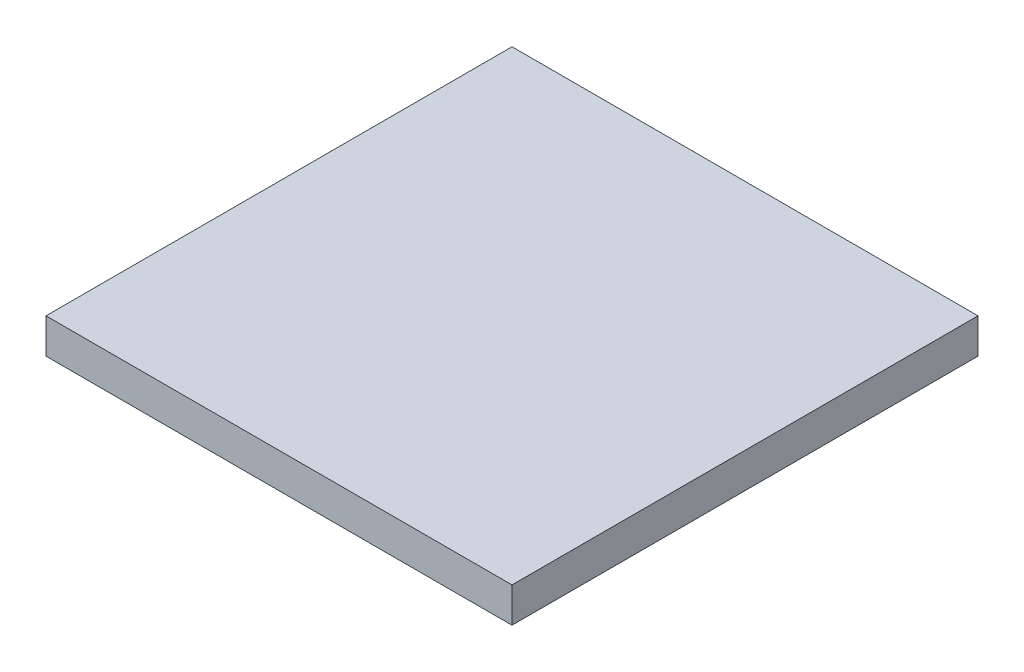
ISO-10303-21;
HEADER;
FILE_DESCRIPTION(('STEP AP214'),'2;1');
FILE_NAME('part.step','',(''),(''),'','','');
FILE_SCHEMA(('AUTOMOTIVE_DESIGN { 1 0 10303 214 1 1 1 1 }'));
ENDSEC;
DATA;
#1=APPLICATION_CONTEXT('core data for automotive mechanical design processes');
#2=APPLICATION_PROTOCOL_DEFINITION('international standard','automotive_design',2000,#1);
#3=PRODUCT_CONTEXT('',#1,'mechanical');
#4=PRODUCT('Part','Part','',(#3));
#5=PRODUCT_RELATED_PRODUCT_CATEGORY('part','',(#4));
#6=PRODUCT_DEFINITION_FORMATION('','',#4);
#7=PRODUCT_DEFINITION_CONTEXT('part definition',#1,'design');
#8=PRODUCT_DEFINITION('design','',#6,#7);
#9=PRODUCT_DEFINITION_SHAPE('','',#8);
#10=(LENGTH_UNIT() NAMED_UNIT(*) SI_UNIT(.MILLI.,.METRE.));
#11=(NAMED_UNIT(*) PLANE_ANGLE_UNIT() SI_UNIT($,.RADIAN.));
#12=(NAMED_UNIT(*) SI_UNIT($,.STERADIAN.) SOLID_ANGLE_UNIT());
#13=UNCERTAINTY_MEASURE_WITH_UNIT(LENGTH_MEASURE(1.E-05),#10,'distance_accuracy_value','');
#14=(GEOMETRIC_REPRESENTATION_CONTEXT(3) GLOBAL_UNCERTAINTY_ASSIGNED_CONTEXT((#13)) GLOBAL_UNIT_ASSIGNED_CONTEXT((#10,
#11,#12)) REPRESENTATION_CONTEXT('',''));
#15=CARTESIAN_POINT('',(0.,0.,0.));
#16=DIRECTION('',(0.,0.,1.));
#17=DIRECTION('',(1.,0.,0.));
#18=AXIS2_PLACEMENT_3D('',#15,#16,#17);
#19=CARTESIAN_POINT('',(-8.38028169014085,1.5,-15.));
#20=DIRECTION('',(1.,0.,0.));
#21=DIRECTION('',(0.,0.,-1.));
#22=AXIS2_PLACEMENT_3D('',#19,#20,#21);
#23=PLANE('',#22);
#24=DIRECTION('',(0.,0.,1.));
#25=VECTOR('',#24,1.);
#26=CARTESIAN_POINT('',(-8.38028169014085,0.,-15.));
#27=LINE('',#26,#25);
#28=CARTESIAN_POINT('',(-8.38028169014085,0.,-15.));
#29=VERTEX_POINT('',#28);
#30=CARTESIAN_POINT('',(-8.38028169014085,0.,5.));
#31=VERTEX_POINT('',#30);
#32=EDGE_CURVE('E107',#29,#31,#27,.T.);
#33=ORIENTED_EDGE('',*,*,#32,.T.);
#34=DIRECTION('',(0.,-1.,0.));
#35=VECTOR('',#34,1.);
#36=CARTESIAN_POINT('',(-8.38028169014085,1.5,5.));
#37=LINE('',#36,#35);
#38=CARTESIAN_POINT('',(-8.38028169014085,1.5,5.));
#39=VERTEX_POINT('',#38);
#40=EDGE_CURVE('E11',#39,#31,#37,.T.);
#41=ORIENTED_EDGE('',*,*,#40,.F.);
#42=DIRECTION('',(0.,0.,1.));
#43=VECTOR('',#42,1.);
#44=CARTESIAN_POINT('',(-8.38028169014085,1.5,-15.));
#45=LINE('',#44,#43);
#46=CARTESIAN_POINT('',(-8.38028169014085,1.5,-15.));
#47=VERTEX_POINT('',#46);
#48=EDGE_CURVE('E91',#47,#39,#45,.T.);
#49=ORIENTED_EDGE('',*,*,#48,.F.);
#50=DIRECTION('',(0.,-1.,0.));
#51=VECTOR('',#50,1.);
#52=CARTESIAN_POINT('',(-8.38028169014085,1.5,-15.));
#53=LINE('',#52,#51);
#54=EDGE_CURVE('E103',#47,#29,#53,.T.);
#55=ORIENTED_EDGE('',*,*,#54,.T.);
#56=EDGE_LOOP('',(#33,#41,#49,#55));
#57=FACE_BOUND('',#56,.T.);
#58=ADVANCED_FACE('F39',(#57),#23,.F.);
#59=CARTESIAN_POINT('',(-8.38028169014085,1.5,5.));
#60=DIRECTION('',(0.,0.,-1.));
#61=DIRECTION('',(-1.,0.,0.));
#62=AXIS2_PLACEMENT_3D('',#59,#60,#61);
#63=PLANE('',#62);
#64=DIRECTION('',(1.,0.,0.));
#65=VECTOR('',#64,1.);
#66=CARTESIAN_POINT('',(-8.38028169014085,0.,5.));
#67=LINE('',#66,#65);
#68=CARTESIAN_POINT('',(11.6197183098592,0.,5.));
#69=VERTEX_POINT('',#68);
#70=EDGE_CURVE('E96',#31,#69,#67,.T.);
#71=ORIENTED_EDGE('',*,*,#70,.T.);
#72=DIRECTION('',(0.,-1.,0.));
#73=VECTOR('',#72,1.);
#74=CARTESIAN_POINT('',(11.6197183098592,1.5,5.));
#75=LINE('',#74,#73);
#76=CARTESIAN_POINT('',(11.6197183098592,1.5,5.));
#77=VERTEX_POINT('',#76);
#78=EDGE_CURVE('E48',#77,#69,#75,.T.);
#79=ORIENTED_EDGE('',*,*,#78,.F.);
#80=DIRECTION('',(1.,0.,0.));
#81=VECTOR('',#80,1.);
#82=CARTESIAN_POINT('',(-8.38028169014085,1.5,5.));
#83=LINE('',#82,#81);
#84=EDGE_CURVE('E86',#39,#77,#83,.T.);
#85=ORIENTED_EDGE('',*,*,#84,.F.);
#86=ORIENTED_EDGE('',*,*,#40,.T.);
#87=EDGE_LOOP('',(#71,#79,#85,#86));
#88=FACE_BOUND('',#87,.T.);
#89=ADVANCED_FACE('F95',(#88),#63,.F.);
#90=CARTESIAN_POINT('',(11.6197183098592,1.5,-15.));
#91=DIRECTION('',(-1.,0.,0.));
#92=DIRECTION('',(0.,0.,1.));
#93=AXIS2_PLACEMENT_3D('',#90,#91,#92);
#94=PLANE('',#93);
#95=DIRECTION('',(0.,0.,-1.));
#96=VECTOR('',#95,1.);
#97=CARTESIAN_POINT('',(11.6197183098592,0.,-15.));
#98=LINE('',#97,#96);
#99=CARTESIAN_POINT('',(11.6197183098592,0.,-15.));
#100=VERTEX_POINT('',#99);
#101=EDGE_CURVE('E73',#69,#100,#98,.T.);
#102=ORIENTED_EDGE('',*,*,#101,.T.);
#103=DIRECTION('',(0.,-1.,0.));
#104=VECTOR('',#103,1.);
#105=CARTESIAN_POINT('',(11.6197183098592,1.5,-15.));
#106=LINE('',#105,#104);
#107=CARTESIAN_POINT('',(11.6197183098592,1.5,-15.));
#108=VERTEX_POINT('',#107);
#109=EDGE_CURVE('E98',#108,#100,#106,.T.);
#110=ORIENTED_EDGE('',*,*,#109,.F.);
#111=DIRECTION('',(0.,0.,-1.));
#112=VECTOR('',#111,1.);
#113=CARTESIAN_POINT('',(11.6197183098592,1.5,-15.));
#114=LINE('',#113,#112);
#115=EDGE_CURVE('E89',#77,#108,#114,.T.);
#116=ORIENTED_EDGE('',*,*,#115,.F.);
#117=ORIENTED_EDGE('',*,*,#78,.T.);
#118=EDGE_LOOP('',(#102,#110,#116,#117));
#119=FACE_BOUND('',#118,.T.);
#120=ADVANCED_FACE('F99',(#119),#94,.F.);
#121=CARTESIAN_POINT('',(-8.38028169014085,1.5,-15.));
#122=DIRECTION('',(0.,0.,1.));
#123=DIRECTION('',(1.,0.,0.));
#124=AXIS2_PLACEMENT_3D('',#121,#122,#123);
#125=PLANE('',#124);
#126=DIRECTION('',(-1.,0.,0.));
#127=VECTOR('',#126,1.);
#128=CARTESIAN_POINT('',(-8.38028169014085,0.,-15.));
#129=LINE('',#128,#127);
#130=EDGE_CURVE('E79',#100,#29,#129,.T.);
#131=ORIENTED_EDGE('',*,*,#130,.T.);
#132=ORIENTED_EDGE('',*,*,#54,.F.);
#133=DIRECTION('',(-1.,0.,0.));
#134=VECTOR('',#133,1.);
#135=CARTESIAN_POINT('',(-8.38028169014085,1.5,-15.));
#136=LINE('',#135,#134);
#137=EDGE_CURVE('E56',#108,#47,#136,.T.);
#138=ORIENTED_EDGE('',*,*,#137,.F.);
#139=ORIENTED_EDGE('',*,*,#109,.T.);
#140=EDGE_LOOP('',(#131,#132,#138,#139));
#141=FACE_BOUND('',#140,.T.);
#142=ADVANCED_FACE('F120',(#141),#125,.F.);
#143=CARTESIAN_POINT('',(0.,1.5,0.));
#144=DIRECTION('',(0.,1.,0.));
#145=DIRECTION('',(0.,0.,1.));
#146=AXIS2_PLACEMENT_3D('',#143,#144,#145);
#147=PLANE('',#146);
#148=ORIENTED_EDGE('',*,*,#48,.T.);
#149=ORIENTED_EDGE('',*,*,#84,.T.);
#150=ORIENTED_EDGE('',*,*,#115,.T.);
#151=ORIENTED_EDGE('',*,*,#137,.T.);
#152=EDGE_LOOP('',(#148,#149,#150,#151));
#153=FACE_BOUND('',#152,.T.);
#154=ADVANCED_FACE('F87',(#153),#147,.T.);
#155=CARTESIAN_POINT('',(0.,0.,0.));
#156=DIRECTION('',(0.,1.,0.));
#157=DIRECTION('',(0.,0.,1.));
#158=AXIS2_PLACEMENT_3D('',#155,#156,#157);
#159=PLANE('',#158);
#160=ORIENTED_EDGE('',*,*,#32,.F.);
#161=ORIENTED_EDGE('',*,*,#130,.F.);
#162=ORIENTED_EDGE('',*,*,#101,.F.);
#163=ORIENTED_EDGE('',*,*,#70,.F.);
#164=EDGE_LOOP('',(#160,#161,#162,#163));
#165=FACE_BOUND('',#164,.T.);
#166=ADVANCED_FACE('F123',(#165),#159,.F.);
#167=CLOSED_SHELL('',(#58,#89,#120,#142,#154,#166));
#168=MANIFOLD_SOLID_BREP('B2',#167);
#169=ADVANCED_BREP_SHAPE_REPRESENTATION('',(#18,#168),#14);
#170=SHAPE_DEFINITION_REPRESENTATION(#9,#169);
ENDSEC;
END-ISO-10303-21;
